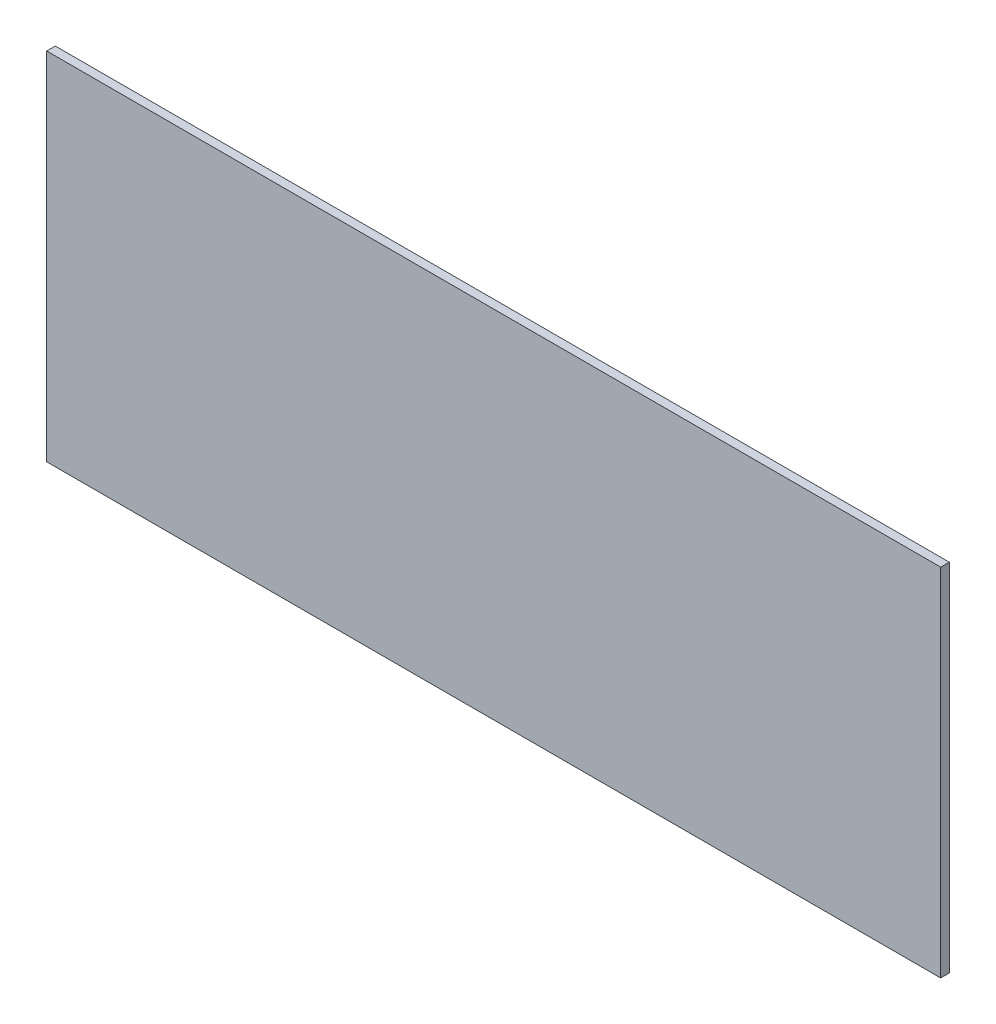
ISO-10303-21;
HEADER;
FILE_DESCRIPTION(('STEP AP214'),'2;1');
FILE_NAME('part.step','',(''),(''),'','','');
FILE_SCHEMA(('AUTOMOTIVE_DESIGN { 1 0 10303 214 1 1 1 1 }'));
ENDSEC;
DATA;
#1=APPLICATION_CONTEXT('core data for automotive mechanical design processes');
#2=APPLICATION_PROTOCOL_DEFINITION('international standard','automotive_design',2000,#1);
#3=PRODUCT_CONTEXT('',#1,'mechanical');
#4=PRODUCT('Part','Part','',(#3));
#5=PRODUCT_RELATED_PRODUCT_CATEGORY('part','',(#4));
#6=PRODUCT_DEFINITION_FORMATION('','',#4);
#7=PRODUCT_DEFINITION_CONTEXT('part definition',#1,'design');
#8=PRODUCT_DEFINITION('design','',#6,#7);
#9=PRODUCT_DEFINITION_SHAPE('','',#8);
#10=(LENGTH_UNIT() NAMED_UNIT(*) SI_UNIT(.MILLI.,.METRE.));
#11=(NAMED_UNIT(*) PLANE_ANGLE_UNIT() SI_UNIT($,.RADIAN.));
#12=(NAMED_UNIT(*) SI_UNIT($,.STERADIAN.) SOLID_ANGLE_UNIT());
#13=UNCERTAINTY_MEASURE_WITH_UNIT(LENGTH_MEASURE(1.E-05),#10,'distance_accuracy_value','');
#14=(GEOMETRIC_REPRESENTATION_CONTEXT(3) GLOBAL_UNCERTAINTY_ASSIGNED_CONTEXT((#13)) GLOBAL_UNIT_ASSIGNED_CONTEXT((#10,
#11,#12)) REPRESENTATION_CONTEXT('',''));
#15=CARTESIAN_POINT('',(0.,0.,0.));
#16=DIRECTION('',(0.,0.,1.));
#17=DIRECTION('',(1.,0.,0.));
#18=AXIS2_PLACEMENT_3D('',#15,#16,#17);
#19=CARTESIAN_POINT('',(-104.,47.8532629561053,-2.));
#20=DIRECTION('',(-1.,0.,0.));
#21=DIRECTION('',(0.,-1.,0.));
#22=AXIS2_PLACEMENT_3D('',#19,#20,#21);
#23=PLANE('',#22);
#24=DIRECTION('',(0.,-1.,0.));
#25=VECTOR('',#24,1.);
#26=CARTESIAN_POINT('',(-104.,47.8532629561053,0.));
#27=LINE('',#26,#25);
#28=CARTESIAN_POINT('',(-104.,47.8532629561053,0.));
#29=VERTEX_POINT('',#28);
#30=CARTESIAN_POINT('',(-104.,-34.9295118338947,0.));
#31=VERTEX_POINT('',#30);
#32=EDGE_CURVE('E99',#29,#31,#27,.T.);
#33=ORIENTED_EDGE('',*,*,#32,.F.);
#34=DIRECTION('',(0.,0.,1.));
#35=VECTOR('',#34,1.);
#36=CARTESIAN_POINT('',(-104.,47.8532629561053,-2.));
#37=LINE('',#36,#35);
#38=CARTESIAN_POINT('',(-104.,47.8532629561053,-2.));
#39=VERTEX_POINT('',#38);
#40=EDGE_CURVE('E11',#39,#29,#37,.T.);
#41=ORIENTED_EDGE('',*,*,#40,.F.);
#42=DIRECTION('',(0.,-1.,0.));
#43=VECTOR('',#42,1.);
#44=CARTESIAN_POINT('',(-104.,47.8532629561053,-2.));
#45=LINE('',#44,#43);
#46=CARTESIAN_POINT('',(-104.,-34.9295118338947,-2.));
#47=VERTEX_POINT('',#46);
#48=EDGE_CURVE('E93',#39,#47,#45,.T.);
#49=ORIENTED_EDGE('',*,*,#48,.T.);
#50=DIRECTION('',(0.,0.,1.));
#51=VECTOR('',#50,1.);
#52=CARTESIAN_POINT('',(-104.,-34.9295118338947,-2.));
#53=LINE('',#52,#51);
#54=EDGE_CURVE('E38',#47,#31,#53,.T.);
#55=ORIENTED_EDGE('',*,*,#54,.T.);
#56=EDGE_LOOP('',(#33,#41,#49,#55));
#57=FACE_BOUND('',#56,.T.);
#58=ADVANCED_FACE('F35',(#57),#23,.T.);
#59=CARTESIAN_POINT('',(104.,47.8532629561053,-2.));
#60=DIRECTION('',(0.,1.,0.));
#61=DIRECTION('',(0.,0.,1.));
#62=AXIS2_PLACEMENT_3D('',#59,#60,#61);
#63=PLANE('',#62);
#64=DIRECTION('',(-1.,0.,0.));
#65=VECTOR('',#64,1.);
#66=CARTESIAN_POINT('',(104.,47.8532629561053,0.));
#67=LINE('',#66,#65);
#68=CARTESIAN_POINT('',(104.,47.8532629561053,0.));
#69=VERTEX_POINT('',#68);
#70=EDGE_CURVE('E95',#69,#29,#67,.T.);
#71=ORIENTED_EDGE('',*,*,#70,.F.);
#72=DIRECTION('',(0.,0.,1.));
#73=VECTOR('',#72,1.);
#74=CARTESIAN_POINT('',(104.,47.8532629561053,-2.));
#75=LINE('',#74,#73);
#76=CARTESIAN_POINT('',(104.,47.8532629561053,-2.));
#77=VERTEX_POINT('',#76);
#78=EDGE_CURVE('E44',#77,#69,#75,.T.);
#79=ORIENTED_EDGE('',*,*,#78,.F.);
#80=DIRECTION('',(-1.,0.,0.));
#81=VECTOR('',#80,1.);
#82=CARTESIAN_POINT('',(104.,47.8532629561053,-2.));
#83=LINE('',#82,#81);
#84=EDGE_CURVE('E90',#77,#39,#83,.T.);
#85=ORIENTED_EDGE('',*,*,#84,.T.);
#86=ORIENTED_EDGE('',*,*,#40,.T.);
#87=EDGE_LOOP('',(#71,#79,#85,#86));
#88=FACE_BOUND('',#87,.T.);
#89=ADVANCED_FACE('F109',(#88),#63,.T.);
#90=CARTESIAN_POINT('',(104.,-34.9295118338947,-2.));
#91=DIRECTION('',(1.,0.,0.));
#92=DIRECTION('',(0.,0.,-1.));
#93=AXIS2_PLACEMENT_3D('',#90,#91,#92);
#94=PLANE('',#93);
#95=DIRECTION('',(0.,1.,0.));
#96=VECTOR('',#95,1.);
#97=CARTESIAN_POINT('',(104.,-34.9295118338947,0.));
#98=LINE('',#97,#96);
#99=CARTESIAN_POINT('',(104.,-34.9295118338947,0.));
#100=VERTEX_POINT('',#99);
#101=EDGE_CURVE('E85',#100,#69,#98,.T.);
#102=ORIENTED_EDGE('',*,*,#101,.F.);
#103=DIRECTION('',(0.,0.,1.));
#104=VECTOR('',#103,1.);
#105=CARTESIAN_POINT('',(104.,-34.9295118338947,-2.));
#106=LINE('',#105,#104);
#107=CARTESIAN_POINT('',(104.,-34.9295118338947,-2.));
#108=VERTEX_POINT('',#107);
#109=EDGE_CURVE('E80',#108,#100,#106,.T.);
#110=ORIENTED_EDGE('',*,*,#109,.F.);
#111=DIRECTION('',(0.,1.,0.));
#112=VECTOR('',#111,1.);
#113=CARTESIAN_POINT('',(104.,-34.9295118338947,-2.));
#114=LINE('',#113,#112);
#115=EDGE_CURVE('E83',#108,#77,#114,.T.);
#116=ORIENTED_EDGE('',*,*,#115,.T.);
#117=ORIENTED_EDGE('',*,*,#78,.T.);
#118=EDGE_LOOP('',(#102,#110,#116,#117));
#119=FACE_BOUND('',#118,.T.);
#120=ADVANCED_FACE('F82',(#119),#94,.T.);
#121=CARTESIAN_POINT('',(-104.,-34.9295118338947,-2.));
#122=DIRECTION('',(0.,-1.,0.));
#123=DIRECTION('',(0.,0.,-1.));
#124=AXIS2_PLACEMENT_3D('',#121,#122,#123);
#125=PLANE('',#124);
#126=DIRECTION('',(1.,0.,0.));
#127=VECTOR('',#126,1.);
#128=CARTESIAN_POINT('',(-104.,-34.9295118338947,0.));
#129=LINE('',#128,#127);
#130=EDGE_CURVE('E102',#31,#100,#129,.T.);
#131=ORIENTED_EDGE('',*,*,#130,.F.);
#132=ORIENTED_EDGE('',*,*,#54,.F.);
#133=DIRECTION('',(1.,0.,0.));
#134=VECTOR('',#133,1.);
#135=CARTESIAN_POINT('',(-104.,-34.9295118338947,-2.));
#136=LINE('',#135,#134);
#137=EDGE_CURVE('E89',#47,#108,#136,.T.);
#138=ORIENTED_EDGE('',*,*,#137,.T.);
#139=ORIENTED_EDGE('',*,*,#109,.T.);
#140=EDGE_LOOP('',(#131,#132,#138,#139));
#141=FACE_BOUND('',#140,.T.);
#142=ADVANCED_FACE('F92',(#141),#125,.T.);
#143=CARTESIAN_POINT('',(0.,0.,-2.));
#144=DIRECTION('',(0.,0.,1.));
#145=DIRECTION('',(1.,0.,0.));
#146=AXIS2_PLACEMENT_3D('',#143,#144,#145);
#147=PLANE('',#146);
#148=ORIENTED_EDGE('',*,*,#48,.F.);
#149=ORIENTED_EDGE('',*,*,#84,.F.);
#150=ORIENTED_EDGE('',*,*,#115,.F.);
#151=ORIENTED_EDGE('',*,*,#137,.F.);
#152=EDGE_LOOP('',(#148,#149,#150,#151));
#153=FACE_BOUND('',#152,.T.);
#154=ADVANCED_FACE('F88',(#153),#147,.F.);
#155=CARTESIAN_POINT('',(0.,0.,0.));
#156=DIRECTION('',(0.,0.,1.));
#157=DIRECTION('',(1.,0.,0.));
#158=AXIS2_PLACEMENT_3D('',#155,#156,#157);
#159=PLANE('',#158);
#160=ORIENTED_EDGE('',*,*,#32,.T.);
#161=ORIENTED_EDGE('',*,*,#130,.T.);
#162=ORIENTED_EDGE('',*,*,#101,.T.);
#163=ORIENTED_EDGE('',*,*,#70,.T.);
#164=EDGE_LOOP('',(#160,#161,#162,#163));
#165=FACE_BOUND('',#164,.T.);
#166=ADVANCED_FACE('F108',(#165),#159,.T.);
#167=CLOSED_SHELL('',(#58,#89,#120,#142,#154,#166));
#168=MANIFOLD_SOLID_BREP('B2',#167);
#169=ADVANCED_BREP_SHAPE_REPRESENTATION('',(#18,#168),#14);
#170=SHAPE_DEFINITION_REPRESENTATION(#9,#169);
ENDSEC;
END-ISO-10303-21;
